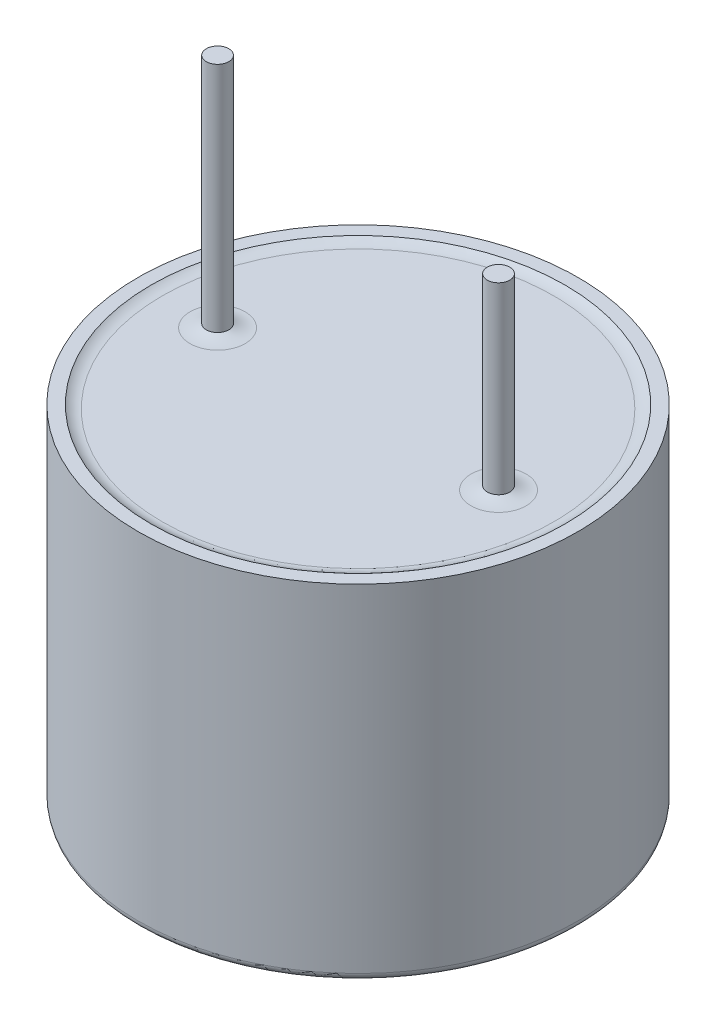
ISO-10303-21;
HEADER;
FILE_DESCRIPTION(('STEP AP214'),'2;1');
FILE_NAME('part.step','',(''),(''),'','','');
FILE_SCHEMA(('AUTOMOTIVE_DESIGN { 1 0 10303 214 1 1 1 1 }'));
ENDSEC;
DATA;
#1=APPLICATION_CONTEXT('core data for automotive mechanical design processes');
#2=APPLICATION_PROTOCOL_DEFINITION('international standard','automotive_design',2000,#1);
#3=PRODUCT_CONTEXT('',#1,'mechanical');
#4=PRODUCT('Part','Part','',(#3));
#5=PRODUCT_RELATED_PRODUCT_CATEGORY('part','',(#4));
#6=PRODUCT_DEFINITION_FORMATION('','',#4);
#7=PRODUCT_DEFINITION_CONTEXT('part definition',#1,'design');
#8=PRODUCT_DEFINITION('design','',#6,#7);
#9=PRODUCT_DEFINITION_SHAPE('','',#8);
#10=(LENGTH_UNIT() NAMED_UNIT(*) SI_UNIT(.MILLI.,.METRE.));
#11=(NAMED_UNIT(*) PLANE_ANGLE_UNIT() SI_UNIT($,.RADIAN.));
#12=(NAMED_UNIT(*) SI_UNIT($,.STERADIAN.) SOLID_ANGLE_UNIT());
#13=UNCERTAINTY_MEASURE_WITH_UNIT(LENGTH_MEASURE(1.E-05),#10,'distance_accuracy_value','');
#14=(GEOMETRIC_REPRESENTATION_CONTEXT(3) GLOBAL_UNCERTAINTY_ASSIGNED_CONTEXT((#13)) GLOBAL_UNIT_ASSIGNED_CONTEXT((#10,
#11,#12)) REPRESENTATION_CONTEXT('',''));
#15=CARTESIAN_POINT('',(0.,0.,0.));
#16=DIRECTION('',(0.,0.,1.));
#17=DIRECTION('',(1.,0.,0.));
#18=AXIS2_PLACEMENT_3D('',#15,#16,#17);
#19=CARTESIAN_POINT('',(-3.75000000000002,30.5,5.27500000000005));
#20=DIRECTION('',(0.,1.,0.));
#21=DIRECTION('',(0.,0.,1.));
#22=AXIS2_PLACEMENT_3D('',#19,#20,#21);
#23=CYLINDRICAL_SURFACE('',#22,0.3);
#24=CARTESIAN_POINT('',(-3.75000000000002,30.5,5.27500000000005));
#25=DIRECTION('',(0.,1.,0.));
#26=DIRECTION('',(0.,0.,1.));
#27=AXIS2_PLACEMENT_3D('',#24,#25,#26);
#28=CIRCLE('',#27,0.3);
#29=CARTESIAN_POINT('',(-3.75000000000002,30.5,5.57500000000005));
#30=VERTEX_POINT('',#29);
#31=EDGE_CURVE('P0_E10',#30,#30,#28,.T.);
#32=ORIENTED_EDGE('',*,*,#31,.T.);
#33=EDGE_LOOP('',(#32));
#34=FACE_BOUND('',#33,.T.);
#35=CARTESIAN_POINT('',(-3.75000000000002,36.7,5.27500000000005));
#36=DIRECTION('',(0.,1.,0.));
#37=DIRECTION('',(0.,0.,1.));
#38=AXIS2_PLACEMENT_3D('',#35,#36,#37);
#39=CIRCLE('',#38,0.3);
#40=CARTESIAN_POINT('',(-3.75000000000002,36.7,5.57500000000005));
#41=VERTEX_POINT('',#40);
#42=EDGE_CURVE('P0_E44',#41,#41,#39,.T.);
#43=ORIENTED_EDGE('',*,*,#42,.F.);
#44=EDGE_LOOP('',(#43));
#45=FACE_BOUND('',#44,.T.);
#46=ADVANCED_FACE('P0_F38',(#34,#45),#23,.T.);
#47=CARTESIAN_POINT('',(-3.45000000000002,30.5,5.27500000000005));
#48=DIRECTION('',(0.,-1.,0.));
#49=DIRECTION('',(0.,0.,-1.));
#50=AXIS2_PLACEMENT_3D('',#47,#48,#49);
#51=PLANE('',#50);
#52=ORIENTED_EDGE('',*,*,#31,.F.);
#53=EDGE_LOOP('',(#52));
#54=FACE_BOUND('',#53,.T.);
#55=ADVANCED_FACE('P0_F53',(#54),#51,.T.);
#56=CARTESIAN_POINT('',(-3.75000000000002,36.7,5.27500000000005));
#57=DIRECTION('',(0.,1.,0.));
#58=DIRECTION('',(0.,0.,1.));
#59=AXIS2_PLACEMENT_3D('',#56,#57,#58);
#60=PLANE('',#59);
#61=ORIENTED_EDGE('',*,*,#42,.T.);
#62=EDGE_LOOP('',(#61));
#63=FACE_BOUND('',#62,.T.);
#64=ADVANCED_FACE('P0_F50',(#63),#60,.T.);
#65=CLOSED_SHELL('',(#46,#55,#64));
#66=MANIFOLD_SOLID_BREP('P0_B2',#65);
#67=CARTESIAN_POINT('',(-3.32495975030057,21.35,5.3176086785821));
#68=DIRECTION('',(0.,1.,0.));
#69=DIRECTION('',(0.,0.,1.));
#70=AXIS2_PLACEMENT_3D('',#67,#68,#69);
#71=PLANE('',#70);
#72=DIRECTION('',(0.,0.,1.));
#73=VECTOR('',#72,1.);
#74=CARTESIAN_POINT('',(-3.4293253179773,21.35,5.41890468621531));
#75=LINE('',#74,#73);
#76=CARTESIAN_POINT('',(-3.4293253179773,21.35,5.91249283576289));
#77=VERTEX_POINT('',#76);
#78=CARTESIAN_POINT('',(-3.4293253179773,21.35,5.41890468621531));
#79=VERTEX_POINT('',#78);
#80=EDGE_CURVE('P1_E111',#77,#79,#75,.F.);
#81=ORIENTED_EDGE('',*,*,#80,.T.);
#82=DIRECTION('',(1.,0.,0.));
#83=VECTOR('',#82,1.);
#84=CARTESIAN_POINT('',(-3.91922997498356,21.35,5.41890468621531));
#85=LINE('',#84,#83);
#86=CARTESIAN_POINT('',(-3.91922997498356,21.35,5.41890468621531));
#87=VERTEX_POINT('',#86);
#88=EDGE_CURVE('P1_E198',#79,#87,#85,.F.);
#89=ORIENTED_EDGE('',*,*,#88,.T.);
#90=DIRECTION('',(0.,0.,1.));
#91=VECTOR('',#90,1.);
#92=CARTESIAN_POINT('',(-3.91922997498356,21.35,5.21262910390178));
#93=LINE('',#92,#91);
#94=CARTESIAN_POINT('',(-3.91922997498356,21.35,5.21262910390178));
#95=VERTEX_POINT('',#94);
#96=EDGE_CURVE('P1_E403',#87,#95,#93,.F.);
#97=ORIENTED_EDGE('',*,*,#96,.T.);
#98=DIRECTION('',(-1.,0.,0.));
#99=VECTOR('',#98,1.);
#100=CARTESIAN_POINT('',(-3.4293253179773,21.35,5.21262910390178));
#101=LINE('',#100,#99);
#102=CARTESIAN_POINT('',(-3.4293253179773,21.35,5.21262910390178));
#103=VERTEX_POINT('',#102);
#104=EDGE_CURVE('P1_E407',#95,#103,#101,.F.);
#105=ORIENTED_EDGE('',*,*,#104,.T.);
#106=DIRECTION('',(0.,0.,1.));
#107=VECTOR('',#106,1.);
#108=CARTESIAN_POINT('',(-3.4293253179773,21.35,4.72272452140132));
#109=LINE('',#108,#107);
#110=CARTESIAN_POINT('',(-3.4293253179773,21.35,4.72272452140132));
#111=VERTEX_POINT('',#110);
#112=EDGE_CURVE('P1_E413',#103,#111,#109,.F.);
#113=ORIENTED_EDGE('',*,*,#112,.T.);
#114=DIRECTION('',(-1.,0.,0.));
#115=VECTOR('',#114,1.);
#116=CARTESIAN_POINT('',(-3.22059409880482,21.35,4.72272452140132));
#117=LINE('',#116,#115);
#118=CARTESIAN_POINT('',(-3.22059409880482,21.35,4.72272452140132));
#119=VERTEX_POINT('',#118);
#120=EDGE_CURVE('P1_E417',#111,#119,#117,.F.);
#121=ORIENTED_EDGE('',*,*,#120,.T.);
#122=DIRECTION('',(0.,0.,-1.));
#123=VECTOR('',#122,1.);
#124=CARTESIAN_POINT('',(-3.22059409880482,21.35,5.21262910390178));
#125=LINE('',#124,#123);
#126=CARTESIAN_POINT('',(-3.22059409880482,21.35,5.21262910390178));
#127=VERTEX_POINT('',#126);
#128=EDGE_CURVE('P1_E421',#119,#127,#125,.F.);
#129=ORIENTED_EDGE('',*,*,#128,.T.);
#130=DIRECTION('',(-1.,0.,0.));
#131=VECTOR('',#130,1.);
#132=CARTESIAN_POINT('',(-2.73068952561759,21.35,5.21262910390178));
#133=LINE('',#132,#131);
#134=CARTESIAN_POINT('',(-2.73068952561759,21.35,5.21262910390178));
#135=VERTEX_POINT('',#134);
#136=EDGE_CURVE('P1_E425',#127,#135,#133,.F.);
#137=ORIENTED_EDGE('',*,*,#136,.T.);
#138=DIRECTION('',(0.,0.,-1.));
#139=VECTOR('',#138,1.);
#140=CARTESIAN_POINT('',(-2.73068952561759,21.35,5.41890468621531));
#141=LINE('',#140,#139);
#142=CARTESIAN_POINT('',(-2.73068952561759,21.35,5.41890468621531));
#143=VERTEX_POINT('',#142);
#144=EDGE_CURVE('P1_E429',#135,#143,#141,.F.);
#145=ORIENTED_EDGE('',*,*,#144,.T.);
#146=DIRECTION('',(1.,0.,0.));
#147=VECTOR('',#146,1.);
#148=CARTESIAN_POINT('',(-3.22059409880482,21.35,5.41890468621531));
#149=LINE('',#148,#147);
#150=CARTESIAN_POINT('',(-3.22059409880482,21.35,5.41890468621531));
#151=VERTEX_POINT('',#150);
#152=EDGE_CURVE('P1_E433',#143,#151,#149,.F.);
#153=ORIENTED_EDGE('',*,*,#152,.T.);
#154=DIRECTION('',(0.,0.,-1.));
#155=VECTOR('',#154,1.);
#156=CARTESIAN_POINT('',(-3.22059409880482,21.35,5.91249283576289));
#157=LINE('',#156,#155);
#158=CARTESIAN_POINT('',(-3.22059409880482,21.35,5.91249283576289));
#159=VERTEX_POINT('',#158);
#160=EDGE_CURVE('P1_E107',#151,#159,#157,.F.);
#161=ORIENTED_EDGE('',*,*,#160,.T.);
#162=DIRECTION('',(1.,0.,0.));
#163=VECTOR('',#162,1.);
#164=CARTESIAN_POINT('',(-3.4293253179773,21.35,5.91249283576289));
#165=LINE('',#164,#163);
#166=EDGE_CURVE('P1_E109',#159,#77,#165,.F.);
#167=ORIENTED_EDGE('',*,*,#166,.T.);
#168=EDGE_LOOP('',(#81,#89,#97,#105,#113,#121,#129,#137,#145,#153,#161,#167));
#169=FACE_BOUND('',#168,.T.);
#170=ADVANCED_FACE('P1_F19',(#169),#71,.F.);
#171=CARTESIAN_POINT('',(-3.4293253179773,21.3,5.41890468621531));
#172=DIRECTION('',(-1.,0.,0.));
#173=DIRECTION('',(0.,0.,1.));
#174=AXIS2_PLACEMENT_3D('',#171,#172,#173);
#175=PLANE('',#174);
#176=DIRECTION('',(0.,1.,0.));
#177=VECTOR('',#176,1.);
#178=CARTESIAN_POINT('',(-3.4293253179773,21.3,5.41890468621531));
#179=LINE('',#178,#177);
#180=CARTESIAN_POINT('',(-3.4293253179773,21.3,5.41890468621531));
#181=VERTEX_POINT('',#180);
#182=EDGE_CURVE('P1_E122',#181,#79,#179,.T.);
#183=ORIENTED_EDGE('',*,*,#182,.T.);
#184=ORIENTED_EDGE('',*,*,#80,.F.);
#185=DIRECTION('',(0.,1.,0.));
#186=VECTOR('',#185,1.);
#187=CARTESIAN_POINT('',(-3.4293253179773,21.3,5.91249283576289));
#188=LINE('',#187,#186);
#189=CARTESIAN_POINT('',(-3.4293253179773,21.3,5.91249283576289));
#190=VERTEX_POINT('',#189);
#191=EDGE_CURVE('P1_E116',#77,#190,#188,.F.);
#192=ORIENTED_EDGE('',*,*,#191,.T.);
#193=DIRECTION('',(0.,0.,-1.));
#194=VECTOR('',#193,1.);
#195=CARTESIAN_POINT('',(-3.4293253179773,21.3,5.27500000000005));
#196=LINE('',#195,#194);
#197=EDGE_CURVE('P1_E195',#181,#190,#196,.F.);
#198=ORIENTED_EDGE('',*,*,#197,.F.);
#199=EDGE_LOOP('',(#183,#184,#192,#198));
#200=FACE_BOUND('',#199,.T.);
#201=ADVANCED_FACE('P1_F119',(#200),#175,.F.);
#202=CARTESIAN_POINT('',(-3.4293253179773,21.3,5.91249283576289));
#203=DIRECTION('',(0.,0.,1.));
#204=DIRECTION('',(1.,0.,0.));
#205=AXIS2_PLACEMENT_3D('',#202,#203,#204);
#206=PLANE('',#205);
#207=ORIENTED_EDGE('',*,*,#191,.F.);
#208=ORIENTED_EDGE('',*,*,#166,.F.);
#209=DIRECTION('',(0.,1.,0.));
#210=VECTOR('',#209,1.);
#211=CARTESIAN_POINT('',(-3.22059409880482,21.3,5.91249283576289));
#212=LINE('',#211,#210);
#213=CARTESIAN_POINT('',(-3.22059409880482,21.3,5.91249283576289));
#214=VERTEX_POINT('',#213);
#215=EDGE_CURVE('P1_E130',#159,#214,#212,.F.);
#216=ORIENTED_EDGE('',*,*,#215,.T.);
#217=DIRECTION('',(1.,0.,0.));
#218=VECTOR('',#217,1.);
#219=CARTESIAN_POINT('',(-0.150000000000017,21.3,5.91249283576289));
#220=LINE('',#219,#218);
#221=EDGE_CURVE('P1_E127',#190,#214,#220,.T.);
#222=ORIENTED_EDGE('',*,*,#221,.F.);
#223=EDGE_LOOP('',(#207,#208,#216,#222));
#224=FACE_BOUND('',#223,.T.);
#225=ADVANCED_FACE('P1_F125',(#224),#206,.F.);
#226=CARTESIAN_POINT('',(-3.22059409880482,21.3,5.91249283576289));
#227=DIRECTION('',(1.,0.,0.));
#228=DIRECTION('',(0.,0.,-1.));
#229=AXIS2_PLACEMENT_3D('',#226,#227,#228);
#230=PLANE('',#229);
#231=ORIENTED_EDGE('',*,*,#215,.F.);
#232=ORIENTED_EDGE('',*,*,#160,.F.);
#233=DIRECTION('',(0.,1.,0.));
#234=VECTOR('',#233,1.);
#235=CARTESIAN_POINT('',(-3.22059409880482,21.3,5.41890468621531));
#236=LINE('',#235,#234);
#237=CARTESIAN_POINT('',(-3.22059409880482,21.3,5.41890468621531));
#238=VERTEX_POINT('',#237);
#239=EDGE_CURVE('P1_E431',#151,#238,#236,.F.);
#240=ORIENTED_EDGE('',*,*,#239,.T.);
#241=DIRECTION('',(0.,0.,-1.));
#242=VECTOR('',#241,1.);
#243=CARTESIAN_POINT('',(-3.22059409880482,21.3,5.27500000000005));
#244=LINE('',#243,#242);
#245=EDGE_CURVE('P1_E190',#214,#238,#244,.T.);
#246=ORIENTED_EDGE('',*,*,#245,.F.);
#247=EDGE_LOOP('',(#231,#232,#240,#246));
#248=FACE_BOUND('',#247,.T.);
#249=ADVANCED_FACE('P1_F367',(#248),#230,.F.);
#250=CARTESIAN_POINT('',(-3.22059409880482,21.3,5.41890468621531));
#251=DIRECTION('',(0.,0.,1.));
#252=DIRECTION('',(1.,0.,0.));
#253=AXIS2_PLACEMENT_3D('',#250,#251,#252);
#254=PLANE('',#253);
#255=ORIENTED_EDGE('',*,*,#239,.F.);
#256=ORIENTED_EDGE('',*,*,#152,.F.);
#257=DIRECTION('',(0.,1.,0.));
#258=VECTOR('',#257,1.);
#259=CARTESIAN_POINT('',(-2.73068952561759,21.3,5.41890468621531));
#260=LINE('',#259,#258);
#261=CARTESIAN_POINT('',(-2.73068952561759,21.3,5.41890468621531));
#262=VERTEX_POINT('',#261);
#263=EDGE_CURVE('P1_E427',#143,#262,#260,.F.);
#264=ORIENTED_EDGE('',*,*,#263,.T.);
#265=DIRECTION('',(1.,0.,0.));
#266=VECTOR('',#265,1.);
#267=CARTESIAN_POINT('',(-0.150000000000017,21.3,5.41890468621531));
#268=LINE('',#267,#266);
#269=EDGE_CURVE('P1_E186',#238,#262,#268,.T.);
#270=ORIENTED_EDGE('',*,*,#269,.F.);
#271=EDGE_LOOP('',(#255,#256,#264,#270));
#272=FACE_BOUND('',#271,.T.);
#273=ADVANCED_FACE('P1_F370',(#272),#254,.F.);
#274=CARTESIAN_POINT('',(-2.73068952561759,21.3,5.41890468621531));
#275=DIRECTION('',(1.,0.,0.));
#276=DIRECTION('',(0.,0.,-1.));
#277=AXIS2_PLACEMENT_3D('',#274,#275,#276);
#278=PLANE('',#277);
#279=ORIENTED_EDGE('',*,*,#263,.F.);
#280=ORIENTED_EDGE('',*,*,#144,.F.);
#281=DIRECTION('',(0.,1.,0.));
#282=VECTOR('',#281,1.);
#283=CARTESIAN_POINT('',(-2.73068952561759,21.3,5.21262910390178));
#284=LINE('',#283,#282);
#285=CARTESIAN_POINT('',(-2.73068952561759,21.3,5.21262910390178));
#286=VERTEX_POINT('',#285);
#287=EDGE_CURVE('P1_E423',#135,#286,#284,.F.);
#288=ORIENTED_EDGE('',*,*,#287,.T.);
#289=DIRECTION('',(0.,0.,-1.));
#290=VECTOR('',#289,1.);
#291=CARTESIAN_POINT('',(-2.73068952561759,21.3,5.27500000000005));
#292=LINE('',#291,#290);
#293=EDGE_CURVE('P1_E183',#262,#286,#292,.T.);
#294=ORIENTED_EDGE('',*,*,#293,.F.);
#295=EDGE_LOOP('',(#279,#280,#288,#294));
#296=FACE_BOUND('',#295,.T.);
#297=ADVANCED_FACE('P1_F374',(#296),#278,.F.);
#298=CARTESIAN_POINT('',(-2.73068952561759,21.3,5.21262910390178));
#299=DIRECTION('',(0.,0.,-1.));
#300=DIRECTION('',(-1.,0.,0.));
#301=AXIS2_PLACEMENT_3D('',#298,#299,#300);
#302=PLANE('',#301);
#303=ORIENTED_EDGE('',*,*,#287,.F.);
#304=ORIENTED_EDGE('',*,*,#136,.F.);
#305=DIRECTION('',(0.,1.,0.));
#306=VECTOR('',#305,1.);
#307=CARTESIAN_POINT('',(-3.22059409880482,21.3,5.21262910390178));
#308=LINE('',#307,#306);
#309=CARTESIAN_POINT('',(-3.22059409880482,21.3,5.21262910390178));
#310=VERTEX_POINT('',#309);
#311=EDGE_CURVE('P1_E419',#127,#310,#308,.F.);
#312=ORIENTED_EDGE('',*,*,#311,.T.);
#313=DIRECTION('',(1.,0.,0.));
#314=VECTOR('',#313,1.);
#315=CARTESIAN_POINT('',(-0.150000000000017,21.3,5.21262910390178));
#316=LINE('',#315,#314);
#317=EDGE_CURVE('P1_E178',#286,#310,#316,.F.);
#318=ORIENTED_EDGE('',*,*,#317,.F.);
#319=EDGE_LOOP('',(#303,#304,#312,#318));
#320=FACE_BOUND('',#319,.T.);
#321=ADVANCED_FACE('P1_F378',(#320),#302,.F.);
#322=CARTESIAN_POINT('',(-3.22059409880482,21.3,5.21262910390178));
#323=DIRECTION('',(1.,0.,0.));
#324=DIRECTION('',(0.,0.,-1.));
#325=AXIS2_PLACEMENT_3D('',#322,#323,#324);
#326=PLANE('',#325);
#327=ORIENTED_EDGE('',*,*,#311,.F.);
#328=ORIENTED_EDGE('',*,*,#128,.F.);
#329=DIRECTION('',(0.,1.,0.));
#330=VECTOR('',#329,1.);
#331=CARTESIAN_POINT('',(-3.22059409880482,21.3,4.72272452140132));
#332=LINE('',#331,#330);
#333=CARTESIAN_POINT('',(-3.22059409880482,21.3,4.72272452140132));
#334=VERTEX_POINT('',#333);
#335=EDGE_CURVE('P1_E415',#119,#334,#332,.F.);
#336=ORIENTED_EDGE('',*,*,#335,.T.);
#337=DIRECTION('',(0.,0.,-1.));
#338=VECTOR('',#337,1.);
#339=CARTESIAN_POINT('',(-3.22059409880482,21.3,5.27500000000005));
#340=LINE('',#339,#338);
#341=EDGE_CURVE('P1_E174',#310,#334,#340,.T.);
#342=ORIENTED_EDGE('',*,*,#341,.F.);
#343=EDGE_LOOP('',(#327,#328,#336,#342));
#344=FACE_BOUND('',#343,.T.);
#345=ADVANCED_FACE('P1_F382',(#344),#326,.F.);
#346=CARTESIAN_POINT('',(-3.22059409880482,21.3,4.72272452140132));
#347=DIRECTION('',(0.,0.,-1.));
#348=DIRECTION('',(-1.,0.,0.));
#349=AXIS2_PLACEMENT_3D('',#346,#347,#348);
#350=PLANE('',#349);
#351=ORIENTED_EDGE('',*,*,#335,.F.);
#352=ORIENTED_EDGE('',*,*,#120,.F.);
#353=DIRECTION('',(0.,1.,0.));
#354=VECTOR('',#353,1.);
#355=CARTESIAN_POINT('',(-3.4293253179773,21.3,4.72272452140132));
#356=LINE('',#355,#354);
#357=CARTESIAN_POINT('',(-3.4293253179773,21.3,4.72272452140132));
#358=VERTEX_POINT('',#357);
#359=EDGE_CURVE('P1_E411',#111,#358,#356,.F.);
#360=ORIENTED_EDGE('',*,*,#359,.T.);
#361=DIRECTION('',(1.,0.,0.));
#362=VECTOR('',#361,1.);
#363=CARTESIAN_POINT('',(-0.150000000000017,21.3,4.72272452140132));
#364=LINE('',#363,#362);
#365=EDGE_CURVE('P1_E171',#334,#358,#364,.F.);
#366=ORIENTED_EDGE('',*,*,#365,.F.);
#367=EDGE_LOOP('',(#351,#352,#360,#366));
#368=FACE_BOUND('',#367,.T.);
#369=ADVANCED_FACE('P1_F386',(#368),#350,.F.);
#370=CARTESIAN_POINT('',(-3.4293253179773,21.3,4.72272452140132));
#371=DIRECTION('',(-1.,0.,0.));
#372=DIRECTION('',(0.,0.,1.));
#373=AXIS2_PLACEMENT_3D('',#370,#371,#372);
#374=PLANE('',#373);
#375=ORIENTED_EDGE('',*,*,#359,.F.);
#376=ORIENTED_EDGE('',*,*,#112,.F.);
#377=DIRECTION('',(0.,1.,0.));
#378=VECTOR('',#377,1.);
#379=CARTESIAN_POINT('',(-3.4293253179773,21.3,5.21262910390178));
#380=LINE('',#379,#378);
#381=CARTESIAN_POINT('',(-3.4293253179773,21.3,5.21262910390178));
#382=VERTEX_POINT('',#381);
#383=EDGE_CURVE('P1_E406',#103,#382,#380,.F.);
#384=ORIENTED_EDGE('',*,*,#383,.T.);
#385=DIRECTION('',(0.,0.,-1.));
#386=VECTOR('',#385,1.);
#387=CARTESIAN_POINT('',(-3.4293253179773,21.3,5.27500000000005));
#388=LINE('',#387,#386);
#389=EDGE_CURVE('P1_E168',#358,#382,#388,.F.);
#390=ORIENTED_EDGE('',*,*,#389,.F.);
#391=EDGE_LOOP('',(#375,#376,#384,#390));
#392=FACE_BOUND('',#391,.T.);
#393=ADVANCED_FACE('P1_F390',(#392),#374,.F.);
#394=CARTESIAN_POINT('',(-3.4293253179773,21.3,5.21262910390178));
#395=DIRECTION('',(0.,0.,-1.));
#396=DIRECTION('',(-1.,0.,0.));
#397=AXIS2_PLACEMENT_3D('',#394,#395,#396);
#398=PLANE('',#397);
#399=ORIENTED_EDGE('',*,*,#383,.F.);
#400=ORIENTED_EDGE('',*,*,#104,.F.);
#401=DIRECTION('',(0.,1.,0.));
#402=VECTOR('',#401,1.);
#403=CARTESIAN_POINT('',(-3.91922997498356,21.3,5.21262910390178));
#404=LINE('',#403,#402);
#405=CARTESIAN_POINT('',(-3.91922997498356,21.3,5.21262910390178));
#406=VERTEX_POINT('',#405);
#407=EDGE_CURVE('P1_E202',#95,#406,#404,.F.);
#408=ORIENTED_EDGE('',*,*,#407,.T.);
#409=DIRECTION('',(1.,0.,0.));
#410=VECTOR('',#409,1.);
#411=CARTESIAN_POINT('',(-0.150000000000017,21.3,5.21262910390178));
#412=LINE('',#411,#410);
#413=EDGE_CURVE('P1_E165',#382,#406,#412,.F.);
#414=ORIENTED_EDGE('',*,*,#413,.F.);
#415=EDGE_LOOP('',(#399,#400,#408,#414));
#416=FACE_BOUND('',#415,.T.);
#417=ADVANCED_FACE('P1_F394',(#416),#398,.F.);
#418=CARTESIAN_POINT('',(-3.91922997498356,21.3,5.21262910390178));
#419=DIRECTION('',(-1.,0.,0.));
#420=DIRECTION('',(0.,0.,1.));
#421=AXIS2_PLACEMENT_3D('',#418,#419,#420);
#422=PLANE('',#421);
#423=ORIENTED_EDGE('',*,*,#407,.F.);
#424=ORIENTED_EDGE('',*,*,#96,.F.);
#425=DIRECTION('',(0.,1.,0.));
#426=VECTOR('',#425,1.);
#427=CARTESIAN_POINT('',(-3.91922997498356,21.3,5.41890468621531));
#428=LINE('',#427,#426);
#429=CARTESIAN_POINT('',(-3.91922997498356,21.3,5.41890468621531));
#430=VERTEX_POINT('',#429);
#431=EDGE_CURVE('P1_E38',#87,#430,#428,.F.);
#432=ORIENTED_EDGE('',*,*,#431,.T.);
#433=DIRECTION('',(0.,0.,-1.));
#434=VECTOR('',#433,1.);
#435=CARTESIAN_POINT('',(-3.91922997498356,21.3,5.27500000000005));
#436=LINE('',#435,#434);
#437=EDGE_CURVE('P1_E158',#406,#430,#436,.F.);
#438=ORIENTED_EDGE('',*,*,#437,.F.);
#439=EDGE_LOOP('',(#423,#424,#432,#438));
#440=FACE_BOUND('',#439,.T.);
#441=ADVANCED_FACE('P1_F257',(#440),#422,.F.);
#442=CARTESIAN_POINT('',(-3.91922997498356,21.3,5.41890468621531));
#443=DIRECTION('',(0.,0.,1.));
#444=DIRECTION('',(1.,0.,0.));
#445=AXIS2_PLACEMENT_3D('',#442,#443,#444);
#446=PLANE('',#445);
#447=ORIENTED_EDGE('',*,*,#431,.F.);
#448=ORIENTED_EDGE('',*,*,#88,.F.);
#449=ORIENTED_EDGE('',*,*,#182,.F.);
#450=DIRECTION('',(1.,0.,0.));
#451=VECTOR('',#450,1.);
#452=CARTESIAN_POINT('',(-0.150000000000017,21.3,5.41890468621531));
#453=LINE('',#452,#451);
#454=EDGE_CURVE('P1_E153',#430,#181,#453,.T.);
#455=ORIENTED_EDGE('',*,*,#454,.F.);
#456=EDGE_LOOP('',(#447,#448,#449,#455));
#457=FACE_BOUND('',#456,.T.);
#458=ADVANCED_FACE('P1_F247',(#457),#446,.F.);
#459=CARTESIAN_POINT('',(-0.150000000000017,21.3,5.27500000000005));
#460=DIRECTION('',(0.,-1.,0.));
#461=DIRECTION('',(0.,0.,-1.));
#462=AXIS2_PLACEMENT_3D('',#459,#460,#461);
#463=PLANE('',#462);
#464=ORIENTED_EDGE('',*,*,#437,.T.);
#465=ORIENTED_EDGE('',*,*,#454,.T.);
#466=ORIENTED_EDGE('',*,*,#197,.T.);
#467=ORIENTED_EDGE('',*,*,#221,.T.);
#468=ORIENTED_EDGE('',*,*,#245,.T.);
#469=ORIENTED_EDGE('',*,*,#269,.T.);
#470=ORIENTED_EDGE('',*,*,#293,.T.);
#471=ORIENTED_EDGE('',*,*,#317,.T.);
#472=ORIENTED_EDGE('',*,*,#341,.T.);
#473=ORIENTED_EDGE('',*,*,#365,.T.);
#474=ORIENTED_EDGE('',*,*,#389,.T.);
#475=ORIENTED_EDGE('',*,*,#413,.T.);
#476=EDGE_LOOP('',(#464,#465,#466,#467,#468,#469,#470,#471,#472,#473,#474,#475));
#477=FACE_BOUND('',#476,.T.);
#478=CARTESIAN_POINT('',(-3.32495970839106,21.3,5.31576689505854));
#479=DIRECTION('',(0.,1.,0.));
#480=DIRECTION('',(0.,0.,1.));
#481=AXIS2_PLACEMENT_3D('',#478,#479,#480);
#482=CIRCLE('',#481,0.75);
#483=CARTESIAN_POINT('',(-3.32495970839106,21.3,6.06576689505854));
#484=VERTEX_POINT('',#483);
#485=EDGE_CURVE('P1_E23',#484,#484,#482,.T.);
#486=ORIENTED_EDGE('',*,*,#485,.F.);
#487=EDGE_LOOP('',(#486));
#488=FACE_BOUND('',#487,.T.);
#489=ADVANCED_FACE('P1_F244',(#477,#488),#463,.T.);
#490=CARTESIAN_POINT('',(0.,24.3,5.27500000000005));
#491=DIRECTION('',(0.,-1.,0.));
#492=DIRECTION('',(0.,0.,-1.));
#493=AXIS2_PLACEMENT_3D('',#490,#491,#492);
#494=PLANE('',#493);
#495=CARTESIAN_POINT('',(0.,24.3,5.27500000000005));
#496=DIRECTION('',(0.,1.,0.));
#497=DIRECTION('',(0.,0.,1.));
#498=AXIS2_PLACEMENT_3D('',#495,#496,#497);
#499=CIRCLE('',#498,2.);
#500=CARTESIAN_POINT('',(0.,24.3,7.27500000000005));
#501=VERTEX_POINT('',#500);
#502=EDGE_CURVE('P1_E235',#501,#501,#499,.F.);
#503=ORIENTED_EDGE('',*,*,#502,.T.);
#504=EDGE_LOOP('',(#503));
#505=FACE_BOUND('',#504,.T.);
#506=ADVANCED_FACE('P1_F246',(#505),#494,.T.);
#507=CARTESIAN_POINT('',(0.,30.5,5.27500000000005));
#508=DIRECTION('',(0.,1.,0.));
#509=DIRECTION('',(0.,0.,1.));
#510=AXIS2_PLACEMENT_3D('',#507,#508,#509);
#511=PLANE('',#510);
#512=CARTESIAN_POINT('',(3.74999999999999,30.5,5.27500000000004));
#513=DIRECTION('',(0.,1.,0.));
#514=DIRECTION('',(0.,0.,1.));
#515=AXIS2_PLACEMENT_3D('',#512,#513,#514);
#516=CIRCLE('',#515,0.299999999999996);
#517=CARTESIAN_POINT('',(3.74999999999999,30.5,5.57500000000004));
#518=VERTEX_POINT('',#517);
#519=EDGE_CURVE('P1_E233',#518,#518,#516,.F.);
#520=ORIENTED_EDGE('',*,*,#519,.F.);
#521=EDGE_LOOP('',(#520));
#522=FACE_BOUND('',#521,.T.);
#523=ADVANCED_FACE('P1_F255',(#522),#511,.T.);
#524=CARTESIAN_POINT('',(0.,30.5,5.27500000000005));
#525=DIRECTION('',(0.,1.,0.));
#526=DIRECTION('',(0.,0.,1.));
#527=AXIS2_PLACEMENT_3D('',#524,#525,#526);
#528=PLANE('',#527);
#529=CARTESIAN_POINT('',(-3.75000000000001,30.5,5.27500000000004));
#530=DIRECTION('',(0.,1.,0.));
#531=DIRECTION('',(0.,0.,1.));
#532=AXIS2_PLACEMENT_3D('',#529,#530,#531);
#533=CIRCLE('',#532,0.299999999999996);
#534=CARTESIAN_POINT('',(-3.75000000000001,30.5,5.57500000000004));
#535=VERTEX_POINT('',#534);
#536=EDGE_CURVE('P1_E230',#535,#535,#533,.F.);
#537=ORIENTED_EDGE('',*,*,#536,.F.);
#538=EDGE_LOOP('',(#537));
#539=FACE_BOUND('',#538,.T.);
#540=ADVANCED_FACE('P1_F341',(#539),#528,.T.);
#541=CARTESIAN_POINT('',(-3.32495970839106,0.,5.31576689505854));
#542=DIRECTION('',(0.,1.,0.));
#543=DIRECTION('',(0.,0.,1.));
#544=AXIS2_PLACEMENT_3D('',#541,#542,#543);
#545=CYLINDRICAL_SURFACE('',#544,0.75);
#546=CARTESIAN_POINT('',(-3.32495970839106,21.35,5.31576689505854));
#547=DIRECTION('',(0.,1.,0.));
#548=DIRECTION('',(0.,0.,1.));
#549=AXIS2_PLACEMENT_3D('',#546,#547,#548);
#550=CIRCLE('',#549,0.75);
#551=CARTESIAN_POINT('',(-3.32495970839106,21.35,6.06576689505854));
#552=VERTEX_POINT('',#551);
#553=EDGE_CURVE('P1_E227',#552,#552,#550,.F.);
#554=ORIENTED_EDGE('',*,*,#553,.T.);
#555=EDGE_LOOP('',(#554));
#556=FACE_BOUND('',#555,.T.);
#557=ORIENTED_EDGE('',*,*,#485,.T.);
#558=EDGE_LOOP('',(#557));
#559=FACE_BOUND('',#558,.T.);
#560=ADVANCED_FACE('P1_F242',(#556,#559),#545,.T.);
#561=CARTESIAN_POINT('',(0.,23.3,5.27500000000005));
#562=DIRECTION('',(0.,1.,0.));
#563=DIRECTION('',(0.,0.,1.));
#564=AXIS2_PLACEMENT_3D('',#561,#562,#563);
#565=CYLINDRICAL_SURFACE('',#564,2.);
#566=ORIENTED_EDGE('',*,*,#502,.F.);
#567=EDGE_LOOP('',(#566));
#568=FACE_BOUND('',#567,.T.);
#569=CARTESIAN_POINT('',(0.,22.3,5.27500000000005));
#570=DIRECTION('',(0.,1.,0.));
#571=DIRECTION('',(0.,0.,1.));
#572=AXIS2_PLACEMENT_3D('',#569,#570,#571);
#573=CIRCLE('',#572,2.);
#574=CARTESIAN_POINT('',(0.,22.3,7.27500000000005));
#575=VERTEX_POINT('',#574);
#576=EDGE_CURVE('P1_E224',#575,#575,#573,.F.);
#577=ORIENTED_EDGE('',*,*,#576,.T.);
#578=EDGE_LOOP('',(#577));
#579=FACE_BOUND('',#578,.T.);
#580=ADVANCED_FACE('P1_F334',(#568,#579),#565,.F.);
#581=CARTESIAN_POINT('',(3.74999999999999,31.4,5.27500000000004));
#582=DIRECTION('',(0.,1.,0.));
#583=DIRECTION('',(0.,0.,1.));
#584=AXIS2_PLACEMENT_3D('',#581,#582,#583);
#585=DEGENERATE_TOROIDAL_SURFACE('',#584,0.735889894354061,0.999999999999998,.T.);
#586=ORIENTED_EDGE('',*,*,#519,.T.);
#587=EDGE_LOOP('',(#586));
#588=FACE_BOUND('',#587,.T.);
#589=CARTESIAN_POINT('',(3.74999999999999,30.4,5.27500000000004));
#590=DIRECTION('',(0.,1.,0.));
#591=DIRECTION('',(0.,0.,1.));
#592=AXIS2_PLACEMENT_3D('',#589,#590,#591);
#593=CIRCLE('',#592,0.735889894354061);
#594=CARTESIAN_POINT('',(3.74999999999999,30.4,6.0108898943541));
#595=VERTEX_POINT('',#594);
#596=EDGE_CURVE('P1_E221',#595,#595,#593,.F.);
#597=ORIENTED_EDGE('',*,*,#596,.F.);
#598=EDGE_LOOP('',(#597));
#599=FACE_BOUND('',#598,.T.);
#600=ADVANCED_FACE('P1_F337',(#588,#599),#585,.F.);
#601=CARTESIAN_POINT('',(-3.75000000000001,31.4,5.27500000000004));
#602=DIRECTION('',(0.,1.,0.));
#603=DIRECTION('',(0.,0.,1.));
#604=AXIS2_PLACEMENT_3D('',#601,#602,#603);
#605=DEGENERATE_TOROIDAL_SURFACE('',#604,0.735889894354062,0.999999999999998,.T.);
#606=ORIENTED_EDGE('',*,*,#536,.T.);
#607=EDGE_LOOP('',(#606));
#608=FACE_BOUND('',#607,.T.);
#609=CARTESIAN_POINT('',(-3.75000000000001,30.4,5.27500000000004));
#610=DIRECTION('',(0.,1.,0.));
#611=DIRECTION('',(0.,0.,1.));
#612=AXIS2_PLACEMENT_3D('',#609,#610,#611);
#613=CIRCLE('',#612,0.735889894354062);
#614=CARTESIAN_POINT('',(-3.75000000000001,30.4,6.0108898943541));
#615=VERTEX_POINT('',#614);
#616=EDGE_CURVE('P1_E218',#615,#615,#613,.F.);
#617=ORIENTED_EDGE('',*,*,#616,.F.);
#618=EDGE_LOOP('',(#617));
#619=FACE_BOUND('',#618,.T.);
#620=ADVANCED_FACE('P1_F21',(#608,#619),#605,.F.);
#621=CARTESIAN_POINT('',(-3.32495970839106,21.35,5.31576689505854));
#622=DIRECTION('',(0.,1.,0.));
#623=DIRECTION('',(0.,0.,1.));
#624=AXIS2_PLACEMENT_3D('',#621,#622,#623);
#625=PLANE('',#624);
#626=ORIENTED_EDGE('',*,*,#553,.F.);
#627=EDGE_LOOP('',(#626));
#628=FACE_BOUND('',#627,.T.);
#629=CARTESIAN_POINT('',(-3.32495970839106,21.35,5.31576689505854));
#630=DIRECTION('',(0.,1.,0.));
#631=DIRECTION('',(0.,0.,1.));
#632=AXIS2_PLACEMENT_3D('',#629,#630,#631);
#633=CIRCLE('',#632,0.95);
#634=CARTESIAN_POINT('',(-3.32495970839106,21.35,6.26576689505854));
#635=VERTEX_POINT('',#634);
#636=EDGE_CURVE('P1_E215',#635,#635,#633,.F.);
#637=ORIENTED_EDGE('',*,*,#636,.T.);
#638=EDGE_LOOP('',(#637));
#639=FACE_BOUND('',#638,.T.);
#640=ADVANCED_FACE('P1_F329',(#628,#639),#625,.F.);
#641=CARTESIAN_POINT('',(0.,22.3,5.27500000000005));
#642=DIRECTION('',(0.,-1.,0.));
#643=DIRECTION('',(0.,0.,-1.));
#644=AXIS2_PLACEMENT_3D('',#641,#642,#643);
#645=PLANE('',#644);
#646=CARTESIAN_POINT('',(0.,22.3,5.27500000000005));
#647=DIRECTION('',(0.,1.,0.));
#648=DIRECTION('',(0.,0.,1.));
#649=AXIS2_PLACEMENT_3D('',#646,#647,#648);
#650=CIRCLE('',#649,1.25);
#651=CARTESIAN_POINT('',(0.,22.3,6.52500000000005));
#652=VERTEX_POINT('',#651);
#653=EDGE_CURVE('P1_E212',#652,#652,#650,.F.);
#654=ORIENTED_EDGE('',*,*,#653,.T.);
#655=EDGE_LOOP('',(#654));
#656=FACE_BOUND('',#655,.T.);
#657=ORIENTED_EDGE('',*,*,#576,.F.);
#658=EDGE_LOOP('',(#657));
#659=FACE_BOUND('',#658,.T.);
#660=ADVANCED_FACE('P1_F325',(#656,#659),#645,.F.);
#661=CARTESIAN_POINT('',(0.,30.4,5.27500000000004));
#662=DIRECTION('',(0.,1.,0.));
#663=DIRECTION('',(0.,0.,1.));
#664=AXIS2_PLACEMENT_3D('',#661,#662,#663);
#665=PLANE('',#664);
#666=ORIENTED_EDGE('',*,*,#616,.T.);
#667=EDGE_LOOP('',(#666));
#668=FACE_BOUND('',#667,.T.);
#669=ORIENTED_EDGE('',*,*,#596,.T.);
#670=EDGE_LOOP('',(#669));
#671=FACE_BOUND('',#670,.T.);
#672=CARTESIAN_POINT('',(0.,30.4,5.27500000000005));
#673=DIRECTION('',(0.,-1.,0.));
#674=DIRECTION('',(-1.,0.,0.));
#675=AXIS2_PLACEMENT_3D('',#672,#673,#674);
#676=CIRCLE('',#675,5.225);
#677=CARTESIAN_POINT('',(-5.22500000000002,30.4,5.27500000000004));
#678=VERTEX_POINT('',#677);
#679=EDGE_CURVE('P1_E211',#678,#678,#676,.F.);
#680=ORIENTED_EDGE('',*,*,#679,.T.);
#681=EDGE_LOOP('',(#680));
#682=FACE_BOUND('',#681,.T.);
#683=ADVANCED_FACE('P1_F315',(#668,#671,#682),#665,.T.);
#684=CARTESIAN_POINT('',(-3.32495970839106,0.,5.31576689505854));
#685=DIRECTION('',(0.,1.,0.));
#686=DIRECTION('',(0.,0.,1.));
#687=AXIS2_PLACEMENT_3D('',#684,#685,#686);
#688=CYLINDRICAL_SURFACE('',#687,0.95);
#689=ORIENTED_EDGE('',*,*,#636,.F.);
#690=EDGE_LOOP('',(#689));
#691=FACE_BOUND('',#690,.T.);
#692=CARTESIAN_POINT('',(-3.32495970839106,21.3,5.31576689505854));
#693=DIRECTION('',(0.,1.,0.));
#694=DIRECTION('',(0.,0.,1.));
#695=AXIS2_PLACEMENT_3D('',#692,#693,#694);
#696=CIRCLE('',#695,0.95);
#697=CARTESIAN_POINT('',(-3.32495970839106,21.3,6.26576689505854));
#698=VERTEX_POINT('',#697);
#699=EDGE_CURVE('P1_E207',#698,#698,#696,.T.);
#700=ORIENTED_EDGE('',*,*,#699,.F.);
#701=EDGE_LOOP('',(#700));
#702=FACE_BOUND('',#701,.T.);
#703=ADVANCED_FACE('P1_F324',(#691,#702),#688,.F.);
#704=CARTESIAN_POINT('',(0.,21.3,5.27500000000005));
#705=DIRECTION('',(0.,1.,0.));
#706=DIRECTION('',(0.,0.,1.));
#707=AXIS2_PLACEMENT_3D('',#704,#705,#706);
#708=CYLINDRICAL_SURFACE('',#707,1.25);
#709=ORIENTED_EDGE('',*,*,#653,.F.);
#710=EDGE_LOOP('',(#709));
#711=FACE_BOUND('',#710,.T.);
#712=CARTESIAN_POINT('',(0.,21.3,5.27500000000005));
#713=DIRECTION('',(0.,1.,0.));
#714=DIRECTION('',(0.,0.,1.));
#715=AXIS2_PLACEMENT_3D('',#712,#713,#714);
#716=CIRCLE('',#715,1.25);
#717=CARTESIAN_POINT('',(0.,21.3,6.52500000000005));
#718=VERTEX_POINT('',#717);
#719=EDGE_CURVE('P1_E141',#718,#718,#716,.T.);
#720=ORIENTED_EDGE('',*,*,#719,.F.);
#721=EDGE_LOOP('',(#720));
#722=FACE_BOUND('',#721,.T.);
#723=ADVANCED_FACE('P1_F301',(#711,#722),#708,.F.);
#724=CARTESIAN_POINT('',(0.,30.9,5.27500000000005));
#725=DIRECTION('',(0.,1.,0.));
#726=DIRECTION('',(1.,0.,0.));
#727=AXIS2_PLACEMENT_3D('',#724,#725,#726);
#728=TOROIDAL_SURFACE('',#727,5.225,0.5);
#729=ORIENTED_EDGE('',*,*,#679,.F.);
#730=EDGE_LOOP('',(#729));
#731=FACE_BOUND('',#730,.T.);
#732=CARTESIAN_POINT('',(0.,30.5,5.27500000000005));
#733=DIRECTION('',(0.,1.,0.));
#734=DIRECTION('',(0.,0.,1.));
#735=AXIS2_PLACEMENT_3D('',#732,#733,#734);
#736=CIRCLE('',#735,5.525);
#737=CARTESIAN_POINT('',(0.,30.5,10.8));
#738=VERTEX_POINT('',#737);
#739=EDGE_CURVE('P1_E137',#738,#738,#736,.T.);
#740=ORIENTED_EDGE('',*,*,#739,.T.);
#741=EDGE_LOOP('',(#740));
#742=FACE_BOUND('',#741,.T.);
#743=ADVANCED_FACE('P1_F295',(#731,#742),#728,.F.);
#744=CARTESIAN_POINT('',(0.,21.3,5.27500000000005));
#745=DIRECTION('',(0.,-1.,0.));
#746=DIRECTION('',(0.,0.,-1.));
#747=AXIS2_PLACEMENT_3D('',#744,#745,#746);
#748=PLANE('',#747);
#749=ORIENTED_EDGE('',*,*,#719,.T.);
#750=EDGE_LOOP('',(#749));
#751=FACE_BOUND('',#750,.T.);
#752=ORIENTED_EDGE('',*,*,#699,.T.);
#753=EDGE_LOOP('',(#752));
#754=FACE_BOUND('',#753,.T.);
#755=CARTESIAN_POINT('',(0.,21.3,5.27500000000005));
#756=DIRECTION('',(0.,1.,0.));
#757=DIRECTION('',(0.,0.,1.));
#758=AXIS2_PLACEMENT_3D('',#755,#756,#757);
#759=CIRCLE('',#758,5.67499999999995);
#760=CARTESIAN_POINT('',(0.,21.3,10.95));
#761=VERTEX_POINT('',#760);
#762=EDGE_CURVE('P1_E136',#761,#761,#759,.T.);
#763=ORIENTED_EDGE('',*,*,#762,.F.);
#764=EDGE_LOOP('',(#763));
#765=FACE_BOUND('',#764,.T.);
#766=ADVANCED_FACE('P1_F287',(#751,#754,#765),#748,.T.);
#767=CARTESIAN_POINT('',(0.,30.5,5.27500000000005));
#768=DIRECTION('',(0.,-1.,0.));
#769=DIRECTION('',(0.,0.,-1.));
#770=AXIS2_PLACEMENT_3D('',#767,#768,#769);
#771=PLANE('',#770);
#772=ORIENTED_EDGE('',*,*,#739,.F.);
#773=EDGE_LOOP('',(#772));
#774=FACE_BOUND('',#773,.T.);
#775=CARTESIAN_POINT('',(0.,30.5,5.27500000000005));
#776=DIRECTION('',(0.,1.,0.));
#777=DIRECTION('',(0.,0.,1.));
#778=AXIS2_PLACEMENT_3D('',#775,#776,#777);
#779=CIRCLE('',#778,5.875);
#780=CARTESIAN_POINT('',(0.,30.5,11.1500000000001));
#781=VERTEX_POINT('',#780);
#782=EDGE_CURVE('P1_E30',#781,#781,#779,.F.);
#783=ORIENTED_EDGE('',*,*,#782,.F.);
#784=EDGE_LOOP('',(#783));
#785=FACE_BOUND('',#784,.T.);
#786=ADVANCED_FACE('P1_F268',(#774,#785),#771,.F.);
#787=CARTESIAN_POINT('',(0.,21.5,5.27500000000005));
#788=DIRECTION('',(0.,-1.,0.));
#789=DIRECTION('',(0.,0.,-1.));
#790=AXIS2_PLACEMENT_3D('',#787,#788,#789);
#791=TOROIDAL_SURFACE('',#790,5.675,0.2);
#792=CARTESIAN_POINT('',(0.,21.5,5.27500000000005));
#793=DIRECTION('',(0.,1.,0.));
#794=DIRECTION('',(0.,0.,1.));
#795=AXIS2_PLACEMENT_3D('',#792,#793,#794);
#796=CIRCLE('',#795,5.875);
#797=CARTESIAN_POINT('',(0.,21.5,11.1500000000001));
#798=VERTEX_POINT('',#797);
#799=EDGE_CURVE('P1_E12',#798,#798,#796,.T.);
#800=ORIENTED_EDGE('',*,*,#799,.F.);
#801=EDGE_LOOP('',(#800));
#802=FACE_BOUND('',#801,.T.);
#803=ORIENTED_EDGE('',*,*,#762,.T.);
#804=EDGE_LOOP('',(#803));
#805=FACE_BOUND('',#804,.T.);
#806=ADVANCED_FACE('P1_F262',(#802,#805),#791,.T.);
#807=CARTESIAN_POINT('',(0.,21.3,5.27500000000005));
#808=DIRECTION('',(0.,1.,0.));
#809=DIRECTION('',(0.,0.,1.));
#810=AXIS2_PLACEMENT_3D('',#807,#808,#809);
#811=CYLINDRICAL_SURFACE('',#810,5.875);
#812=ORIENTED_EDGE('',*,*,#799,.T.);
#813=EDGE_LOOP('',(#812));
#814=FACE_BOUND('',#813,.T.);
#815=ORIENTED_EDGE('',*,*,#782,.T.);
#816=EDGE_LOOP('',(#815));
#817=FACE_BOUND('',#816,.T.);
#818=ADVANCED_FACE('P1_F260',(#814,#817),#811,.T.);
#819=CLOSED_SHELL('',(#170,#201,#225,#249,#273,#297,#321,#345,#369,#393,#417,#441,#458,#489,
#506,#523,#540,#560,#580,#600,#620,#640,#660,#683,#703,#723,#743,#766,#786,#806,#818));
#820=MANIFOLD_SOLID_BREP('P1_B1',#819);
#821=CARTESIAN_POINT('',(3.74999999999998,35.4,5.27500000000005));
#822=DIRECTION('',(0.,1.,0.));
#823=DIRECTION('',(0.,0.,1.));
#824=AXIS2_PLACEMENT_3D('',#821,#822,#823);
#825=PLANE('',#824);
#826=CARTESIAN_POINT('',(3.74999999999998,35.4,5.27500000000005));
#827=DIRECTION('',(0.,1.,0.));
#828=DIRECTION('',(0.,0.,1.));
#829=AXIS2_PLACEMENT_3D('',#826,#827,#828);
#830=CIRCLE('',#829,0.3);
#831=CARTESIAN_POINT('',(3.74999999999998,35.4,5.57500000000005));
#832=VERTEX_POINT('',#831);
#833=EDGE_CURVE('P2_E19',#832,#832,#830,.F.);
#834=ORIENTED_EDGE('',*,*,#833,.F.);
#835=EDGE_LOOP('',(#834));
#836=FACE_BOUND('',#835,.T.);
#837=ADVANCED_FACE('P2_F16',(#836),#825,.T.);
#838=CARTESIAN_POINT('',(0.,30.5,5.27500000000005));
#839=DIRECTION('',(0.,1.,0.));
#840=DIRECTION('',(0.,0.,1.));
#841=AXIS2_PLACEMENT_3D('',#838,#839,#840);
#842=PLANE('',#841);
#843=CARTESIAN_POINT('',(3.74999999999998,30.5,5.27500000000005));
#844=DIRECTION('',(0.,1.,0.));
#845=DIRECTION('',(0.,0.,1.));
#846=AXIS2_PLACEMENT_3D('',#843,#844,#845);
#847=CIRCLE('',#846,0.3);
#848=CARTESIAN_POINT('',(3.74999999999998,30.5,5.57500000000005));
#849=VERTEX_POINT('',#848);
#850=EDGE_CURVE('P2_E11',#849,#849,#847,.T.);
#851=ORIENTED_EDGE('',*,*,#850,.F.);
#852=EDGE_LOOP('',(#851));
#853=FACE_BOUND('',#852,.T.);
#854=ADVANCED_FACE('P2_F31',(#853),#842,.F.);
#855=CARTESIAN_POINT('',(3.74999999999998,30.4,5.27500000000005));
#856=DIRECTION('',(0.,1.,0.));
#857=DIRECTION('',(0.,0.,1.));
#858=AXIS2_PLACEMENT_3D('',#855,#856,#857);
#859=CYLINDRICAL_SURFACE('',#858,0.3);
#860=ORIENTED_EDGE('',*,*,#850,.T.);
#861=EDGE_LOOP('',(#860));
#862=FACE_BOUND('',#861,.T.);
#863=ORIENTED_EDGE('',*,*,#833,.T.);
#864=EDGE_LOOP('',(#863));
#865=FACE_BOUND('',#864,.T.);
#866=ADVANCED_FACE('P2_F28',(#862,#865),#859,.T.);
#867=CLOSED_SHELL('',(#837,#854,#866));
#868=MANIFOLD_SOLID_BREP('P2_B1',#867);
#869=ADVANCED_BREP_SHAPE_REPRESENTATION('',(#18,#66,#820,#868),#14);
#870=SHAPE_DEFINITION_REPRESENTATION(#9,#869);
ENDSEC;
END-ISO-10303-21;
